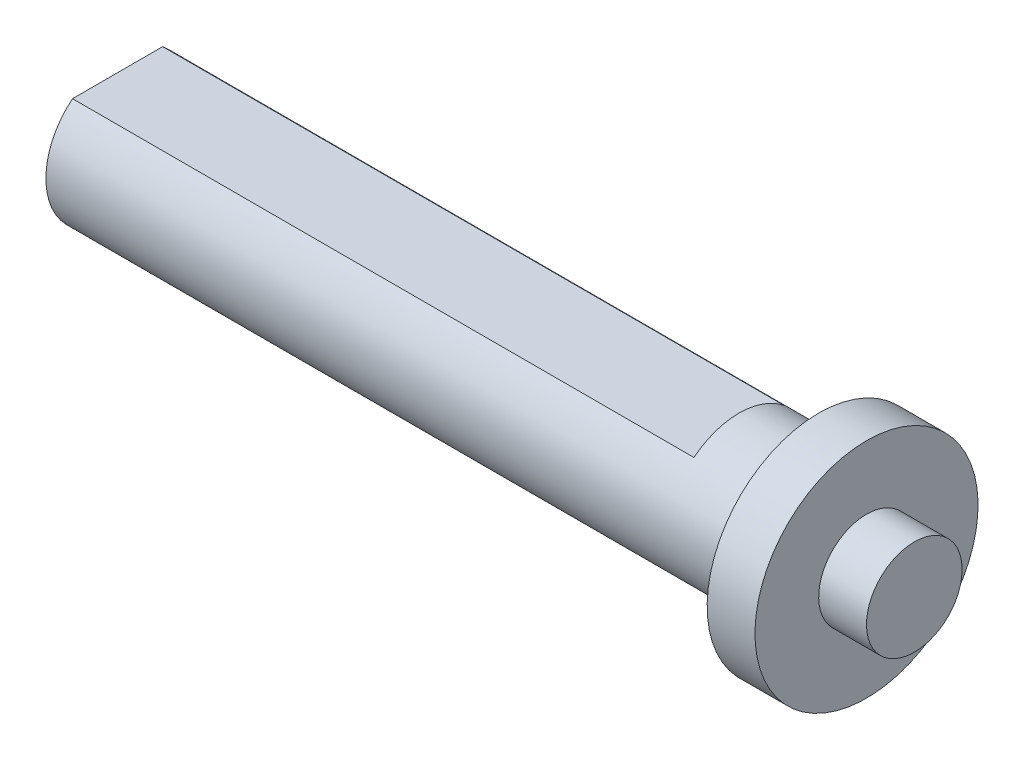
ISO-10303-21;
HEADER;
FILE_DESCRIPTION(('STEP AP214'),'2;1');
FILE_NAME('part.step','',(''),(''),'','','');
FILE_SCHEMA(('AUTOMOTIVE_DESIGN { 1 0 10303 214 1 1 1 1 }'));
ENDSEC;
DATA;
#1=APPLICATION_CONTEXT('core data for automotive mechanical design processes');
#2=APPLICATION_PROTOCOL_DEFINITION('international standard','automotive_design',2000,#1);
#3=PRODUCT_CONTEXT('',#1,'mechanical');
#4=PRODUCT('Part','Part','',(#3));
#5=PRODUCT_RELATED_PRODUCT_CATEGORY('part','',(#4));
#6=PRODUCT_DEFINITION_FORMATION('','',#4);
#7=PRODUCT_DEFINITION_CONTEXT('part definition',#1,'design');
#8=PRODUCT_DEFINITION('design','',#6,#7);
#9=PRODUCT_DEFINITION_SHAPE('','',#8);
#10=(LENGTH_UNIT() NAMED_UNIT(*) SI_UNIT(.MILLI.,.METRE.));
#11=(NAMED_UNIT(*) PLANE_ANGLE_UNIT() SI_UNIT($,.RADIAN.));
#12=(NAMED_UNIT(*) SI_UNIT($,.STERADIAN.) SOLID_ANGLE_UNIT());
#13=UNCERTAINTY_MEASURE_WITH_UNIT(LENGTH_MEASURE(1.E-05),#10,'distance_accuracy_value','');
#14=(GEOMETRIC_REPRESENTATION_CONTEXT(3) GLOBAL_UNCERTAINTY_ASSIGNED_CONTEXT((#13)) GLOBAL_UNIT_ASSIGNED_CONTEXT((#10,
#11,#12)) REPRESENTATION_CONTEXT('',''));
#15=CARTESIAN_POINT('',(0.,0.,0.));
#16=DIRECTION('',(0.,0.,1.));
#17=DIRECTION('',(1.,0.,0.));
#18=AXIS2_PLACEMENT_3D('',#15,#16,#17);
#19=CARTESIAN_POINT('',(0.,0.,0.));
#20=DIRECTION('',(1.,0.,0.));
#21=DIRECTION('',(0.,1.,0.));
#22=AXIS2_PLACEMENT_3D('',#19,#20,#21);
#23=CYLINDRICAL_SURFACE('',#22,4.5);
#24=CARTESIAN_POINT('',(0.,0.,0.));
#25=DIRECTION('',(1.,0.,0.));
#26=DIRECTION('',(0.,1.,0.));
#27=AXIS2_PLACEMENT_3D('',#24,#25,#26);
#28=CIRCLE('',#27,4.5);
#29=CARTESIAN_POINT('',(0.,4.5,0.));
#30=VERTEX_POINT('',#29);
#31=EDGE_CURVE('E100',#30,#30,#28,.T.);
#32=ORIENTED_EDGE('',*,*,#31,.F.);
#33=EDGE_LOOP('',(#32));
#34=FACE_BOUND('',#33,.T.);
#35=CARTESIAN_POINT('',(-5.,0.,0.));
#36=DIRECTION('',(-1.,0.,0.));
#37=DIRECTION('',(0.,-1.,0.));
#38=AXIS2_PLACEMENT_3D('',#35,#36,#37);
#39=CIRCLE('',#38,4.5);
#40=CARTESIAN_POINT('',(-5.,-3.5,2.82842712474619));
#41=VERTEX_POINT('',#40);
#42=CARTESIAN_POINT('',(-5.,-3.5,-2.82842712474619));
#43=VERTEX_POINT('',#42);
#44=EDGE_CURVE('E11',#41,#43,#39,.F.);
#45=ORIENTED_EDGE('',*,*,#44,.T.);
#46=DIRECTION('',(1.,0.,0.));
#47=VECTOR('',#46,1.);
#48=CARTESIAN_POINT('',(0.,-3.5,-2.82842712474619));
#49=LINE('',#48,#47);
#50=CARTESIAN_POINT('',(-44.,-3.5,-2.82842712474619));
#51=VERTEX_POINT('',#50);
#52=EDGE_CURVE('E81',#43,#51,#49,.F.);
#53=ORIENTED_EDGE('',*,*,#52,.T.);
#54=CARTESIAN_POINT('',(-44.,0.,0.));
#55=DIRECTION('',(1.,0.,0.));
#56=DIRECTION('',(0.,1.,0.));
#57=AXIS2_PLACEMENT_3D('',#54,#55,#56);
#58=CIRCLE('',#57,4.5);
#59=CARTESIAN_POINT('',(-44.,3.5,-2.82842712474619));
#60=VERTEX_POINT('',#59);
#61=EDGE_CURVE('E96',#51,#60,#58,.T.);
#62=ORIENTED_EDGE('',*,*,#61,.T.);
#63=DIRECTION('',(1.,0.,0.));
#64=VECTOR('',#63,1.);
#65=CARTESIAN_POINT('',(0.,3.5,-2.82842712474619));
#66=LINE('',#65,#64);
#67=CARTESIAN_POINT('',(-5.,3.5,-2.82842712474619));
#68=VERTEX_POINT('',#67);
#69=EDGE_CURVE('E120',#68,#60,#66,.F.);
#70=ORIENTED_EDGE('',*,*,#69,.F.);
#71=CARTESIAN_POINT('',(-5.,0.,0.));
#72=DIRECTION('',(-1.,0.,0.));
#73=DIRECTION('',(0.,-1.,0.));
#74=AXIS2_PLACEMENT_3D('',#71,#72,#73);
#75=CIRCLE('',#74,4.5);
#76=CARTESIAN_POINT('',(-5.,3.5,2.82842712474619));
#77=VERTEX_POINT('',#76);
#78=EDGE_CURVE('E115',#68,#77,#75,.F.);
#79=ORIENTED_EDGE('',*,*,#78,.T.);
#80=DIRECTION('',(1.,0.,0.));
#81=VECTOR('',#80,1.);
#82=CARTESIAN_POINT('',(0.,3.5,2.82842712474619));
#83=LINE('',#82,#81);
#84=CARTESIAN_POINT('',(-44.,3.5,2.82842712474619));
#85=VERTEX_POINT('',#84);
#86=EDGE_CURVE('E118',#85,#77,#83,.T.);
#87=ORIENTED_EDGE('',*,*,#86,.F.);
#88=CARTESIAN_POINT('',(-44.,-3.50000000000001,2.82842712474619));
#89=VERTEX_POINT('',#88);
#90=EDGE_CURVE('E98',#85,#89,#58,.T.);
#91=ORIENTED_EDGE('',*,*,#90,.T.);
#92=DIRECTION('',(1.,0.,0.));
#93=VECTOR('',#92,1.);
#94=CARTESIAN_POINT('',(0.,-3.5,2.82842712474619));
#95=LINE('',#94,#93);
#96=EDGE_CURVE('E54',#89,#41,#95,.T.);
#97=ORIENTED_EDGE('',*,*,#96,.T.);
#98=EDGE_LOOP('',(#45,#53,#62,#70,#79,#87,#91,#97));
#99=FACE_BOUND('',#98,.T.);
#100=ADVANCED_FACE('F39',(#34,#99),#23,.T.);
#101=CARTESIAN_POINT('',(-44.,0.,0.));
#102=DIRECTION('',(1.,0.,0.));
#103=DIRECTION('',(0.,1.,0.));
#104=AXIS2_PLACEMENT_3D('',#101,#102,#103);
#105=PLANE('',#104);
#106=DIRECTION('',(0.,0.,-1.));
#107=VECTOR('',#106,1.);
#108=CARTESIAN_POINT('',(-44.,-3.50000000000001,0.));
#109=LINE('',#108,#107);
#110=EDGE_CURVE('E47',#89,#51,#109,.T.);
#111=ORIENTED_EDGE('',*,*,#110,.F.);
#112=ORIENTED_EDGE('',*,*,#90,.F.);
#113=DIRECTION('',(0.,0.,1.));
#114=VECTOR('',#113,1.);
#115=CARTESIAN_POINT('',(-44.,3.5,-5.));
#116=LINE('',#115,#114);
#117=EDGE_CURVE('E62',#60,#85,#116,.T.);
#118=ORIENTED_EDGE('',*,*,#117,.F.);
#119=ORIENTED_EDGE('',*,*,#61,.F.);
#120=EDGE_LOOP('',(#111,#112,#118,#119));
#121=FACE_BOUND('',#120,.T.);
#122=ADVANCED_FACE('F41',(#121),#105,.F.);
#123=CARTESIAN_POINT('',(6.,0.,0.));
#124=DIRECTION('',(1.,0.,0.));
#125=DIRECTION('',(0.,1.,0.));
#126=AXIS2_PLACEMENT_3D('',#123,#124,#125);
#127=PLANE('',#126);
#128=CARTESIAN_POINT('',(6.,0.,0.));
#129=DIRECTION('',(1.,0.,0.));
#130=DIRECTION('',(0.,1.,0.));
#131=AXIS2_PLACEMENT_3D('',#128,#129,#130);
#132=CIRCLE('',#131,3.);
#133=CARTESIAN_POINT('',(6.,3.,0.));
#134=VERTEX_POINT('',#133);
#135=EDGE_CURVE('E112',#134,#134,#132,.T.);
#136=ORIENTED_EDGE('',*,*,#135,.T.);
#137=EDGE_LOOP('',(#136));
#138=FACE_BOUND('',#137,.T.);
#139=ADVANCED_FACE('F145',(#138),#127,.T.);
#140=CARTESIAN_POINT('',(0.,0.,0.));
#141=DIRECTION('',(1.,0.,0.));
#142=DIRECTION('',(0.,1.,0.));
#143=AXIS2_PLACEMENT_3D('',#140,#141,#142);
#144=CYLINDRICAL_SURFACE('',#143,3.);
#145=ORIENTED_EDGE('',*,*,#135,.F.);
#146=EDGE_LOOP('',(#145));
#147=FACE_BOUND('',#146,.T.);
#148=CARTESIAN_POINT('',(3.,0.,0.));
#149=DIRECTION('',(1.,0.,0.));
#150=DIRECTION('',(0.,1.,0.));
#151=AXIS2_PLACEMENT_3D('',#148,#149,#150);
#152=CIRCLE('',#151,3.);
#153=CARTESIAN_POINT('',(3.,3.,0.));
#154=VERTEX_POINT('',#153);
#155=EDGE_CURVE('E109',#154,#154,#152,.T.);
#156=ORIENTED_EDGE('',*,*,#155,.T.);
#157=EDGE_LOOP('',(#156));
#158=FACE_BOUND('',#157,.T.);
#159=ADVANCED_FACE('F154',(#147,#158),#144,.T.);
#160=CARTESIAN_POINT('',(3.,0.,0.));
#161=DIRECTION('',(1.,0.,0.));
#162=DIRECTION('',(0.,1.,0.));
#163=AXIS2_PLACEMENT_3D('',#160,#161,#162);
#164=PLANE('',#163);
#165=CARTESIAN_POINT('',(3.,0.,0.));
#166=DIRECTION('',(1.,0.,0.));
#167=DIRECTION('',(0.,1.,0.));
#168=AXIS2_PLACEMENT_3D('',#165,#166,#167);
#169=CIRCLE('',#168,7.);
#170=CARTESIAN_POINT('',(3.,7.,0.));
#171=VERTEX_POINT('',#170);
#172=EDGE_CURVE('E106',#171,#171,#169,.T.);
#173=ORIENTED_EDGE('',*,*,#172,.T.);
#174=EDGE_LOOP('',(#173));
#175=FACE_BOUND('',#174,.T.);
#176=ORIENTED_EDGE('',*,*,#155,.F.);
#177=EDGE_LOOP('',(#176));
#178=FACE_BOUND('',#177,.T.);
#179=ADVANCED_FACE('F150',(#175,#178),#164,.T.);
#180=CARTESIAN_POINT('',(0.,0.,0.));
#181=DIRECTION('',(1.,0.,0.));
#182=DIRECTION('',(0.,1.,0.));
#183=AXIS2_PLACEMENT_3D('',#180,#181,#182);
#184=CYLINDRICAL_SURFACE('',#183,7.);
#185=ORIENTED_EDGE('',*,*,#172,.F.);
#186=EDGE_LOOP('',(#185));
#187=FACE_BOUND('',#186,.T.);
#188=CARTESIAN_POINT('',(0.,0.,0.));
#189=DIRECTION('',(1.,0.,0.));
#190=DIRECTION('',(0.,1.,0.));
#191=AXIS2_PLACEMENT_3D('',#188,#189,#190);
#192=CIRCLE('',#191,7.);
#193=CARTESIAN_POINT('',(0.,7.,0.));
#194=VERTEX_POINT('',#193);
#195=EDGE_CURVE('E103',#194,#194,#192,.T.);
#196=ORIENTED_EDGE('',*,*,#195,.T.);
#197=EDGE_LOOP('',(#196));
#198=FACE_BOUND('',#197,.T.);
#199=ADVANCED_FACE('F136',(#187,#198),#184,.T.);
#200=CARTESIAN_POINT('',(0.,0.,0.));
#201=DIRECTION('',(1.,0.,0.));
#202=DIRECTION('',(0.,1.,0.));
#203=AXIS2_PLACEMENT_3D('',#200,#201,#202);
#204=PLANE('',#203);
#205=ORIENTED_EDGE('',*,*,#195,.F.);
#206=EDGE_LOOP('',(#205));
#207=FACE_BOUND('',#206,.T.);
#208=ORIENTED_EDGE('',*,*,#31,.T.);
#209=EDGE_LOOP('',(#208));
#210=FACE_BOUND('',#209,.T.);
#211=ADVANCED_FACE('F129',(#207,#210),#204,.F.);
#212=CARTESIAN_POINT('',(-5.,0.,-5.));
#213=DIRECTION('',(-1.,0.,0.));
#214=DIRECTION('',(0.,-1.,0.));
#215=AXIS2_PLACEMENT_3D('',#212,#213,#214);
#216=PLANE('',#215);
#217=DIRECTION('',(0.,0.,1.));
#218=VECTOR('',#217,1.);
#219=CARTESIAN_POINT('',(-5.,3.5,-5.));
#220=LINE('',#219,#218);
#221=EDGE_CURVE('E93',#68,#77,#220,.T.);
#222=ORIENTED_EDGE('',*,*,#221,.T.);
#223=ORIENTED_EDGE('',*,*,#78,.F.);
#224=EDGE_LOOP('',(#222,#223));
#225=FACE_BOUND('',#224,.T.);
#226=ADVANCED_FACE('F127',(#225),#216,.T.);
#227=CARTESIAN_POINT('',(0.,3.5,-5.));
#228=DIRECTION('',(0.,-1.,0.));
#229=DIRECTION('',(1.,0.,0.));
#230=AXIS2_PLACEMENT_3D('',#227,#228,#229);
#231=PLANE('',#230);
#232=ORIENTED_EDGE('',*,*,#69,.T.);
#233=ORIENTED_EDGE('',*,*,#117,.T.);
#234=ORIENTED_EDGE('',*,*,#86,.T.);
#235=ORIENTED_EDGE('',*,*,#221,.F.);
#236=EDGE_LOOP('',(#232,#233,#234,#235));
#237=FACE_BOUND('',#236,.T.);
#238=ADVANCED_FACE('F123',(#237),#231,.F.);
#239=CARTESIAN_POINT('',(0.,-3.5,-5.));
#240=DIRECTION('',(0.,-1.,0.));
#241=DIRECTION('',(1.,0.,0.));
#242=AXIS2_PLACEMENT_3D('',#239,#240,#241);
#243=PLANE('',#242);
#244=DIRECTION('',(0.,0.,1.));
#245=VECTOR('',#244,1.);
#246=CARTESIAN_POINT('',(-5.,-3.5,-5.));
#247=LINE('',#246,#245);
#248=EDGE_CURVE('E87',#43,#41,#247,.T.);
#249=ORIENTED_EDGE('',*,*,#248,.T.);
#250=ORIENTED_EDGE('',*,*,#96,.F.);
#251=ORIENTED_EDGE('',*,*,#110,.T.);
#252=ORIENTED_EDGE('',*,*,#52,.F.);
#253=EDGE_LOOP('',(#249,#250,#251,#252));
#254=FACE_BOUND('',#253,.T.);
#255=ADVANCED_FACE('F86',(#254),#243,.T.);
#256=CARTESIAN_POINT('',(-5.,0.,-5.));
#257=DIRECTION('',(-1.,0.,0.));
#258=DIRECTION('',(0.,-1.,0.));
#259=AXIS2_PLACEMENT_3D('',#256,#257,#258);
#260=PLANE('',#259);
#261=ORIENTED_EDGE('',*,*,#44,.F.);
#262=ORIENTED_EDGE('',*,*,#248,.F.);
#263=EDGE_LOOP('',(#261,#262));
#264=FACE_BOUND('',#263,.T.);
#265=ADVANCED_FACE('F89',(#264),#260,.T.);
#266=CLOSED_SHELL('',(#100,#122,#139,#159,#179,#199,#211,#226,#238,#255,#265));
#267=MANIFOLD_SOLID_BREP('B2',#266);
#268=ADVANCED_BREP_SHAPE_REPRESENTATION('',(#18,#267),#14);
#269=SHAPE_DEFINITION_REPRESENTATION(#9,#268);
ENDSEC;
END-ISO-10303-21;
